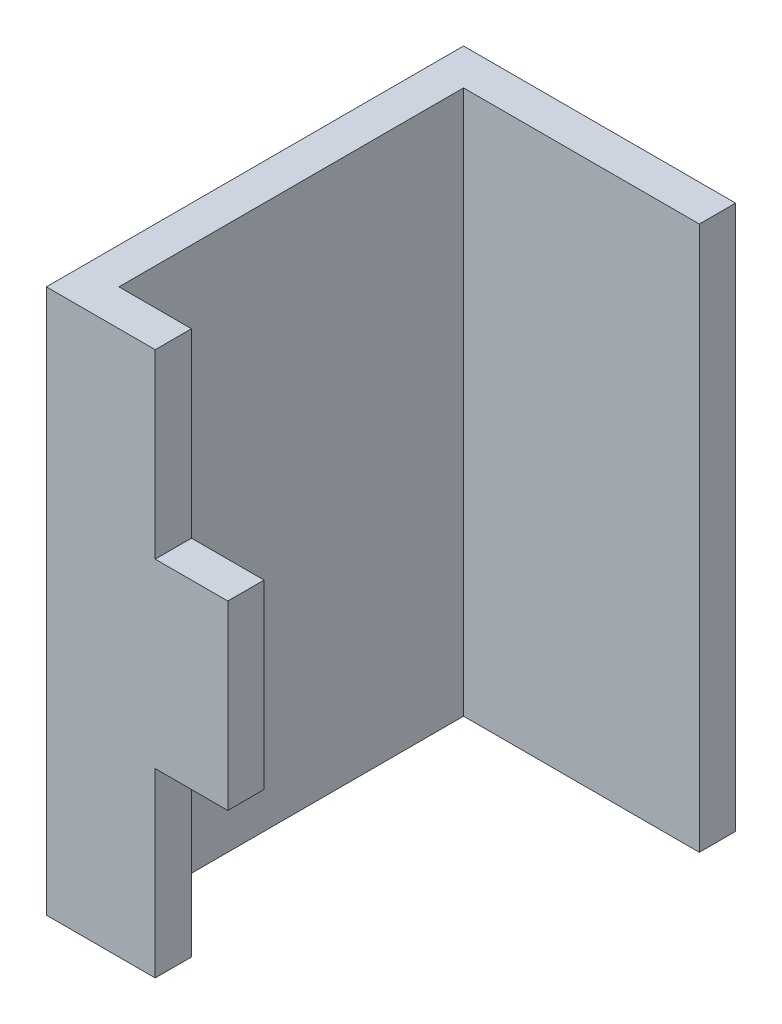
ISO-10303-21;
HEADER;
FILE_DESCRIPTION(('STEP AP214'),'2;1');
FILE_NAME('part.step','',(''),(''),'','','');
FILE_SCHEMA(('AUTOMOTIVE_DESIGN { 1 0 10303 214 1 1 1 1 }'));
ENDSEC;
DATA;
#1=APPLICATION_CONTEXT('core data for automotive mechanical design processes');
#2=APPLICATION_PROTOCOL_DEFINITION('international standard','automotive_design',2000,#1);
#3=PRODUCT_CONTEXT('',#1,'mechanical');
#4=PRODUCT('Part','Part','',(#3));
#5=PRODUCT_RELATED_PRODUCT_CATEGORY('part','',(#4));
#6=PRODUCT_DEFINITION_FORMATION('','',#4);
#7=PRODUCT_DEFINITION_CONTEXT('part definition',#1,'design');
#8=PRODUCT_DEFINITION('design','',#6,#7);
#9=PRODUCT_DEFINITION_SHAPE('','',#8);
#10=(LENGTH_UNIT() NAMED_UNIT(*) SI_UNIT(.MILLI.,.METRE.));
#11=(NAMED_UNIT(*) PLANE_ANGLE_UNIT() SI_UNIT($,.RADIAN.));
#12=(NAMED_UNIT(*) SI_UNIT($,.STERADIAN.) SOLID_ANGLE_UNIT());
#13=UNCERTAINTY_MEASURE_WITH_UNIT(LENGTH_MEASURE(1.E-05),#10,'distance_accuracy_value','');
#14=(GEOMETRIC_REPRESENTATION_CONTEXT(3) GLOBAL_UNCERTAINTY_ASSIGNED_CONTEXT((#13)) GLOBAL_UNIT_ASSIGNED_CONTEXT((#10,
#11,#12)) REPRESENTATION_CONTEXT('',''));
#15=CARTESIAN_POINT('',(0.,0.,0.));
#16=DIRECTION('',(0.,0.,1.));
#17=DIRECTION('',(1.,0.,0.));
#18=AXIS2_PLACEMENT_3D('',#15,#16,#17);
#19=CARTESIAN_POINT('',(7.69,2.458309395645,1.00916));
#20=DIRECTION('',(0.,0.,-1.));
#21=DIRECTION('',(-1.,0.,0.));
#22=AXIS2_PLACEMENT_3D('',#19,#20,#21);
#23=PLANE('',#22);
#24=DIRECTION('',(0.,1.,0.));
#25=VECTOR('',#24,1.);
#26=CARTESIAN_POINT('',(7.69,2.458309395645,1.00916));
#27=LINE('',#26,#25);
#28=CARTESIAN_POINT('',(7.69,3.0329,1.00916));
#29=VERTEX_POINT('',#28);
#30=CARTESIAN_POINT('',(7.69,2.7329,1.00916));
#31=VERTEX_POINT('',#30);
#32=EDGE_CURVE('E123',#29,#31,#27,.F.);
#33=ORIENTED_EDGE('',*,*,#32,.F.);
#34=DIRECTION('',(-1.,0.,0.));
#35=VECTOR('',#34,1.);
#36=CARTESIAN_POINT('',(7.69,3.0329,1.00916));
#37=LINE('',#36,#35);
#38=CARTESIAN_POINT('',(7.73,3.0329,1.00916));
#39=VERTEX_POINT('',#38);
#40=EDGE_CURVE('E111',#29,#39,#37,.F.);
#41=ORIENTED_EDGE('',*,*,#40,.T.);
#42=DIRECTION('',(0.,1.,0.));
#43=VECTOR('',#42,1.);
#44=CARTESIAN_POINT('',(7.73,3.0329,1.00916));
#45=LINE('',#44,#43);
#46=CARTESIAN_POINT('',(7.73,2.9329,1.00916));
#47=VERTEX_POINT('',#46);
#48=EDGE_CURVE('E117',#39,#47,#45,.F.);
#49=ORIENTED_EDGE('',*,*,#48,.T.);
#50=DIRECTION('',(1.,0.,0.));
#51=VECTOR('',#50,1.);
#52=CARTESIAN_POINT('',(7.73,2.9329,1.00916));
#53=LINE('',#52,#51);
#54=CARTESIAN_POINT('',(7.77,2.9329,1.00916));
#55=VERTEX_POINT('',#54);
#56=EDGE_CURVE('E144',#47,#55,#53,.T.);
#57=ORIENTED_EDGE('',*,*,#56,.T.);
#58=DIRECTION('',(0.,1.,0.));
#59=VECTOR('',#58,1.);
#60=CARTESIAN_POINT('',(7.77,2.458309395645,1.00916));
#61=LINE('',#60,#59);
#62=CARTESIAN_POINT('',(7.77,2.8329,1.00916));
#63=VERTEX_POINT('',#62);
#64=EDGE_CURVE('E139',#63,#55,#61,.T.);
#65=ORIENTED_EDGE('',*,*,#64,.F.);
#66=DIRECTION('',(1.,0.,0.));
#67=VECTOR('',#66,1.);
#68=CARTESIAN_POINT('',(7.73,2.8329,1.00916));
#69=LINE('',#68,#67);
#70=CARTESIAN_POINT('',(7.73,2.8329,1.00916));
#71=VERTEX_POINT('',#70);
#72=EDGE_CURVE('E134',#63,#71,#69,.F.);
#73=ORIENTED_EDGE('',*,*,#72,.T.);
#74=DIRECTION('',(0.,1.,0.));
#75=VECTOR('',#74,1.);
#76=CARTESIAN_POINT('',(7.73,2.7329,1.00916));
#77=LINE('',#76,#75);
#78=CARTESIAN_POINT('',(7.73,2.7329,1.00916));
#79=VERTEX_POINT('',#78);
#80=EDGE_CURVE('E103',#71,#79,#77,.F.);
#81=ORIENTED_EDGE('',*,*,#80,.T.);
#82=DIRECTION('',(-1.,0.,0.));
#83=VECTOR('',#82,1.);
#84=CARTESIAN_POINT('',(7.69,2.7329,1.00916));
#85=LINE('',#84,#83);
#86=EDGE_CURVE('E20',#79,#31,#85,.T.);
#87=ORIENTED_EDGE('',*,*,#86,.T.);
#88=EDGE_LOOP('',(#33,#41,#49,#57,#65,#73,#81,#87));
#89=FACE_BOUND('',#88,.T.);
#90=ADVANCED_FACE('F17',(#89),#23,.T.);
#91=CARTESIAN_POINT('',(7.73,3.0329,0.901456703857));
#92=DIRECTION('',(-1.,0.,0.));
#93=DIRECTION('',(0.,0.,1.));
#94=AXIS2_PLACEMENT_3D('',#91,#92,#93);
#95=PLANE('',#94);
#96=DIRECTION('',(0.,0.,1.));
#97=VECTOR('',#96,1.);
#98=CARTESIAN_POINT('',(7.73,3.0329,0.901456703857));
#99=LINE('',#98,#97);
#100=CARTESIAN_POINT('',(7.73,3.0329,1.02916));
#101=VERTEX_POINT('',#100);
#102=EDGE_CURVE('E107',#101,#39,#99,.F.);
#103=ORIENTED_EDGE('',*,*,#102,.F.);
#104=DIRECTION('',(0.,1.,0.));
#105=VECTOR('',#104,1.);
#106=CARTESIAN_POINT('',(7.73,2.458309395645,1.02916));
#107=LINE('',#106,#105);
#108=CARTESIAN_POINT('',(7.73,2.9329,1.02916));
#109=VERTEX_POINT('',#108);
#110=EDGE_CURVE('E161',#109,#101,#107,.T.);
#111=ORIENTED_EDGE('',*,*,#110,.F.);
#112=DIRECTION('',(0.,0.,-1.));
#113=VECTOR('',#112,1.);
#114=CARTESIAN_POINT('',(7.73,2.9329,0.901456703857));
#115=LINE('',#114,#113);
#116=EDGE_CURVE('E127',#109,#47,#115,.T.);
#117=ORIENTED_EDGE('',*,*,#116,.T.);
#118=ORIENTED_EDGE('',*,*,#48,.F.);
#119=EDGE_LOOP('',(#103,#111,#117,#118));
#120=FACE_BOUND('',#119,.T.);
#121=ADVANCED_FACE('F125',(#120),#95,.F.);
#122=CARTESIAN_POINT('',(7.73,2.7329,0.901456703857));
#123=DIRECTION('',(-1.,0.,0.));
#124=DIRECTION('',(0.,0.,1.));
#125=AXIS2_PLACEMENT_3D('',#122,#123,#124);
#126=PLANE('',#125);
#127=DIRECTION('',(0.,0.,1.));
#128=VECTOR('',#127,1.);
#129=CARTESIAN_POINT('',(7.73,2.8329,0.901456703857));
#130=LINE('',#129,#128);
#131=CARTESIAN_POINT('',(7.73,2.8329,1.02916));
#132=VERTEX_POINT('',#131);
#133=EDGE_CURVE('E130',#71,#132,#130,.T.);
#134=ORIENTED_EDGE('',*,*,#133,.T.);
#135=DIRECTION('',(0.,1.,0.));
#136=VECTOR('',#135,1.);
#137=CARTESIAN_POINT('',(7.73,2.458309395645,1.02916));
#138=LINE('',#137,#136);
#139=CARTESIAN_POINT('',(7.73,2.7329,1.02916));
#140=VERTEX_POINT('',#139);
#141=EDGE_CURVE('E166',#140,#132,#138,.T.);
#142=ORIENTED_EDGE('',*,*,#141,.F.);
#143=DIRECTION('',(0.,0.,1.));
#144=VECTOR('',#143,1.);
#145=CARTESIAN_POINT('',(7.73,2.7329,1.00916));
#146=LINE('',#145,#144);
#147=EDGE_CURVE('E159',#140,#79,#146,.F.);
#148=ORIENTED_EDGE('',*,*,#147,.T.);
#149=ORIENTED_EDGE('',*,*,#80,.F.);
#150=EDGE_LOOP('',(#134,#142,#148,#149));
#151=FACE_BOUND('',#150,.T.);
#152=ADVANCED_FACE('F218',(#151),#126,.F.);
#153=CARTESIAN_POINT('',(7.73,2.8329,0.901456703857));
#154=DIRECTION('',(0.,1.,0.));
#155=DIRECTION('',(0.,0.,1.));
#156=AXIS2_PLACEMENT_3D('',#153,#154,#155);
#157=PLANE('',#156);
#158=DIRECTION('',(0.,0.,-1.));
#159=VECTOR('',#158,1.);
#160=CARTESIAN_POINT('',(7.77,2.8329,1.00916));
#161=LINE('',#160,#159);
#162=CARTESIAN_POINT('',(7.77,2.8329,1.02916));
#163=VERTEX_POINT('',#162);
#164=EDGE_CURVE('E136',#163,#63,#161,.T.);
#165=ORIENTED_EDGE('',*,*,#164,.F.);
#166=DIRECTION('',(1.,0.,0.));
#167=VECTOR('',#166,1.);
#168=CARTESIAN_POINT('',(7.77,2.8329,1.02916));
#169=LINE('',#168,#167);
#170=EDGE_CURVE('E169',#132,#163,#169,.T.);
#171=ORIENTED_EDGE('',*,*,#170,.F.);
#172=ORIENTED_EDGE('',*,*,#133,.F.);
#173=ORIENTED_EDGE('',*,*,#72,.F.);
#174=EDGE_LOOP('',(#165,#171,#172,#173));
#175=FACE_BOUND('',#174,.T.);
#176=ADVANCED_FACE('F216',(#175),#157,.F.);
#177=CARTESIAN_POINT('',(7.77,2.458309395645,1.00916));
#178=DIRECTION('',(1.,0.,0.));
#179=DIRECTION('',(0.,0.,-1.));
#180=AXIS2_PLACEMENT_3D('',#177,#178,#179);
#181=PLANE('',#180);
#182=ORIENTED_EDGE('',*,*,#164,.T.);
#183=ORIENTED_EDGE('',*,*,#64,.T.);
#184=DIRECTION('',(0.,0.,-1.));
#185=VECTOR('',#184,1.);
#186=CARTESIAN_POINT('',(7.77,2.9329,0.901456703857));
#187=LINE('',#186,#185);
#188=CARTESIAN_POINT('',(7.77,2.9329,1.02916));
#189=VERTEX_POINT('',#188);
#190=EDGE_CURVE('E141',#55,#189,#187,.F.);
#191=ORIENTED_EDGE('',*,*,#190,.T.);
#192=DIRECTION('',(0.,1.,0.));
#193=VECTOR('',#192,1.);
#194=CARTESIAN_POINT('',(7.77,2.458309395645,1.02916));
#195=LINE('',#194,#193);
#196=EDGE_CURVE('E172',#163,#189,#195,.T.);
#197=ORIENTED_EDGE('',*,*,#196,.F.);
#198=EDGE_LOOP('',(#182,#183,#191,#197));
#199=FACE_BOUND('',#198,.T.);
#200=ADVANCED_FACE('F213',(#199),#181,.T.);
#201=CARTESIAN_POINT('',(7.73,2.9329,0.901456703857));
#202=DIRECTION('',(0.,-1.,0.));
#203=DIRECTION('',(0.,0.,-1.));
#204=AXIS2_PLACEMENT_3D('',#201,#202,#203);
#205=PLANE('',#204);
#206=ORIENTED_EDGE('',*,*,#116,.F.);
#207=DIRECTION('',(1.,0.,0.));
#208=VECTOR('',#207,1.);
#209=CARTESIAN_POINT('',(7.77,2.9329,1.02916));
#210=LINE('',#209,#208);
#211=EDGE_CURVE('E175',#189,#109,#210,.F.);
#212=ORIENTED_EDGE('',*,*,#211,.F.);
#213=ORIENTED_EDGE('',*,*,#190,.F.);
#214=ORIENTED_EDGE('',*,*,#56,.F.);
#215=EDGE_LOOP('',(#206,#212,#213,#214));
#216=FACE_BOUND('',#215,.T.);
#217=ADVANCED_FACE('F207',(#216),#205,.F.);
#218=CARTESIAN_POINT('',(7.69,2.458309395645,0.81916));
#219=DIRECTION('',(1.,0.,0.));
#220=DIRECTION('',(0.,0.,-1.));
#221=AXIS2_PLACEMENT_3D('',#218,#219,#220);
#222=PLANE('',#221);
#223=DIRECTION('',(0.,0.,1.));
#224=VECTOR('',#223,1.);
#225=CARTESIAN_POINT('',(7.69,3.0329,0.81916));
#226=LINE('',#225,#224);
#227=CARTESIAN_POINT('',(7.69,3.0329,0.81916));
#228=VERTEX_POINT('',#227);
#229=EDGE_CURVE('E178',#29,#228,#226,.F.);
#230=ORIENTED_EDGE('',*,*,#229,.F.);
#231=ORIENTED_EDGE('',*,*,#32,.T.);
#232=DIRECTION('',(0.,0.,1.));
#233=VECTOR('',#232,1.);
#234=CARTESIAN_POINT('',(7.69,2.7329,1.00916));
#235=LINE('',#234,#233);
#236=CARTESIAN_POINT('',(7.69,2.7329,0.81916));
#237=VERTEX_POINT('',#236);
#238=EDGE_CURVE('E153',#31,#237,#235,.F.);
#239=ORIENTED_EDGE('',*,*,#238,.T.);
#240=DIRECTION('',(0.,-1.,0.));
#241=VECTOR('',#240,1.);
#242=CARTESIAN_POINT('',(7.69,2.458309395645,0.81916));
#243=LINE('',#242,#241);
#244=EDGE_CURVE('E147',#228,#237,#243,.T.);
#245=ORIENTED_EDGE('',*,*,#244,.F.);
#246=EDGE_LOOP('',(#230,#231,#239,#245));
#247=FACE_BOUND('',#246,.T.);
#248=ADVANCED_FACE('F224',(#247),#222,.T.);
#249=CARTESIAN_POINT('',(7.82,2.458309395645,0.81916));
#250=DIRECTION('',(0.,0.,1.));
#251=DIRECTION('',(0.,-1.,0.));
#252=AXIS2_PLACEMENT_3D('',#249,#250,#251);
#253=PLANE('',#252);
#254=DIRECTION('',(1.,0.,0.));
#255=VECTOR('',#254,1.);
#256=CARTESIAN_POINT('',(7.97,3.0329,0.81916));
#257=LINE('',#256,#255);
#258=CARTESIAN_POINT('',(7.82,3.0329,0.81916));
#259=VERTEX_POINT('',#258);
#260=EDGE_CURVE('E180',#228,#259,#257,.T.);
#261=ORIENTED_EDGE('',*,*,#260,.F.);
#262=ORIENTED_EDGE('',*,*,#244,.T.);
#263=DIRECTION('',(1.,0.,0.));
#264=VECTOR('',#263,1.);
#265=CARTESIAN_POINT('',(7.69,2.7329,0.81916));
#266=LINE('',#265,#264);
#267=CARTESIAN_POINT('',(7.82,2.7329,0.81916));
#268=VERTEX_POINT('',#267);
#269=EDGE_CURVE('E155',#237,#268,#266,.T.);
#270=ORIENTED_EDGE('',*,*,#269,.T.);
#271=DIRECTION('',(0.,1.,0.));
#272=VECTOR('',#271,1.);
#273=CARTESIAN_POINT('',(7.82,2.458309395645,0.81916));
#274=LINE('',#273,#272);
#275=EDGE_CURVE('E150',#259,#268,#274,.F.);
#276=ORIENTED_EDGE('',*,*,#275,.F.);
#277=EDGE_LOOP('',(#261,#262,#270,#276));
#278=FACE_BOUND('',#277,.T.);
#279=ADVANCED_FACE('F229',(#278),#253,.T.);
#280=CARTESIAN_POINT('',(7.82,2.458309395645,0.79916));
#281=DIRECTION('',(1.,0.,0.));
#282=DIRECTION('',(0.,0.,-1.));
#283=AXIS2_PLACEMENT_3D('',#280,#281,#282);
#284=PLANE('',#283);
#285=DIRECTION('',(0.,0.,1.));
#286=VECTOR('',#285,1.);
#287=CARTESIAN_POINT('',(7.82,3.0329,0.81916));
#288=LINE('',#287,#286);
#289=CARTESIAN_POINT('',(7.82,3.0329,0.79916));
#290=VERTEX_POINT('',#289);
#291=EDGE_CURVE('E183',#259,#290,#288,.F.);
#292=ORIENTED_EDGE('',*,*,#291,.F.);
#293=ORIENTED_EDGE('',*,*,#275,.T.);
#294=DIRECTION('',(0.,0.,1.));
#295=VECTOR('',#294,1.);
#296=CARTESIAN_POINT('',(7.82,2.7329,1.00916));
#297=LINE('',#296,#295);
#298=CARTESIAN_POINT('',(7.82,2.7329,0.79916));
#299=VERTEX_POINT('',#298);
#300=EDGE_CURVE('E157',#268,#299,#297,.F.);
#301=ORIENTED_EDGE('',*,*,#300,.T.);
#302=DIRECTION('',(0.,1.,0.));
#303=VECTOR('',#302,1.);
#304=CARTESIAN_POINT('',(7.82,2.458309395645,0.79916));
#305=LINE('',#304,#303);
#306=EDGE_CURVE('E190',#290,#299,#305,.F.);
#307=ORIENTED_EDGE('',*,*,#306,.F.);
#308=EDGE_LOOP('',(#292,#293,#301,#307));
#309=FACE_BOUND('',#308,.T.);
#310=ADVANCED_FACE('F232',(#309),#284,.T.);
#311=CARTESIAN_POINT('',(7.69,2.7329,1.00916));
#312=DIRECTION('',(0.,1.,0.));
#313=DIRECTION('',(0.,0.,1.));
#314=AXIS2_PLACEMENT_3D('',#311,#312,#313);
#315=PLANE('',#314);
#316=ORIENTED_EDGE('',*,*,#147,.F.);
#317=DIRECTION('',(1.,0.,0.));
#318=VECTOR('',#317,1.);
#319=CARTESIAN_POINT('',(7.77,2.7329,1.02916));
#320=LINE('',#319,#318);
#321=CARTESIAN_POINT('',(7.67,2.7329,1.02916));
#322=VERTEX_POINT('',#321);
#323=EDGE_CURVE('E163',#322,#140,#320,.T.);
#324=ORIENTED_EDGE('',*,*,#323,.F.);
#325=DIRECTION('',(0.,0.,1.));
#326=VECTOR('',#325,1.);
#327=CARTESIAN_POINT('',(7.67,2.7329,1.02916));
#328=LINE('',#327,#326);
#329=CARTESIAN_POINT('',(7.67,2.7329,0.79916));
#330=VERTEX_POINT('',#329);
#331=EDGE_CURVE('E193',#330,#322,#328,.T.);
#332=ORIENTED_EDGE('',*,*,#331,.F.);
#333=DIRECTION('',(-1.,0.,0.));
#334=VECTOR('',#333,1.);
#335=CARTESIAN_POINT('',(7.67,2.7329,0.79916));
#336=LINE('',#335,#334);
#337=EDGE_CURVE('E186',#299,#330,#336,.T.);
#338=ORIENTED_EDGE('',*,*,#337,.F.);
#339=ORIENTED_EDGE('',*,*,#300,.F.);
#340=ORIENTED_EDGE('',*,*,#269,.F.);
#341=ORIENTED_EDGE('',*,*,#238,.F.);
#342=ORIENTED_EDGE('',*,*,#86,.F.);
#343=EDGE_LOOP('',(#316,#324,#332,#338,#339,#340,#341,#342));
#344=FACE_BOUND('',#343,.T.);
#345=ADVANCED_FACE('F220',(#344),#315,.F.);
#346=CARTESIAN_POINT('',(7.77,2.458309395645,1.02916));
#347=DIRECTION('',(0.,0.,1.));
#348=DIRECTION('',(1.,0.,0.));
#349=AXIS2_PLACEMENT_3D('',#346,#347,#348);
#350=PLANE('',#349);
#351=ORIENTED_EDGE('',*,*,#196,.T.);
#352=ORIENTED_EDGE('',*,*,#211,.T.);
#353=ORIENTED_EDGE('',*,*,#110,.T.);
#354=DIRECTION('',(1.,0.,0.));
#355=VECTOR('',#354,1.);
#356=CARTESIAN_POINT('',(7.97,3.0329,1.02916));
#357=LINE('',#356,#355);
#358=CARTESIAN_POINT('',(7.67,3.0329,1.02916));
#359=VERTEX_POINT('',#358);
#360=EDGE_CURVE('E113',#359,#101,#357,.T.);
#361=ORIENTED_EDGE('',*,*,#360,.F.);
#362=DIRECTION('',(0.,1.,0.));
#363=VECTOR('',#362,1.);
#364=CARTESIAN_POINT('',(7.67,2.458309395645,1.02916));
#365=LINE('',#364,#363);
#366=EDGE_CURVE('E196',#322,#359,#365,.T.);
#367=ORIENTED_EDGE('',*,*,#366,.F.);
#368=ORIENTED_EDGE('',*,*,#323,.T.);
#369=ORIENTED_EDGE('',*,*,#141,.T.);
#370=ORIENTED_EDGE('',*,*,#170,.T.);
#371=EDGE_LOOP('',(#351,#352,#353,#361,#367,#368,#369,#370));
#372=FACE_BOUND('',#371,.T.);
#373=ADVANCED_FACE('F204',(#372),#350,.T.);
#374=CARTESIAN_POINT('',(7.97,3.0329,0.81916));
#375=DIRECTION('',(0.,1.,0.));
#376=DIRECTION('',(0.,0.,1.));
#377=AXIS2_PLACEMENT_3D('',#374,#375,#376);
#378=PLANE('',#377);
#379=DIRECTION('',(0.,0.,1.));
#380=VECTOR('',#379,1.);
#381=CARTESIAN_POINT('',(7.67,3.0329,1.02916));
#382=LINE('',#381,#380);
#383=CARTESIAN_POINT('',(7.67,3.0329,0.79916));
#384=VERTEX_POINT('',#383);
#385=EDGE_CURVE('E26',#359,#384,#382,.F.);
#386=ORIENTED_EDGE('',*,*,#385,.F.);
#387=ORIENTED_EDGE('',*,*,#360,.T.);
#388=ORIENTED_EDGE('',*,*,#102,.T.);
#389=ORIENTED_EDGE('',*,*,#40,.F.);
#390=ORIENTED_EDGE('',*,*,#229,.T.);
#391=ORIENTED_EDGE('',*,*,#260,.T.);
#392=ORIENTED_EDGE('',*,*,#291,.T.);
#393=DIRECTION('',(-1.,0.,0.));
#394=VECTOR('',#393,1.);
#395=CARTESIAN_POINT('',(7.67,3.0329,0.79916));
#396=LINE('',#395,#394);
#397=EDGE_CURVE('E35',#384,#290,#396,.F.);
#398=ORIENTED_EDGE('',*,*,#397,.F.);
#399=EDGE_LOOP('',(#386,#387,#388,#389,#390,#391,#392,#398));
#400=FACE_BOUND('',#399,.T.);
#401=ADVANCED_FACE('F109',(#400),#378,.T.);
#402=CARTESIAN_POINT('',(7.67,2.458309395645,0.79916));
#403=DIRECTION('',(0.,0.,-1.));
#404=DIRECTION('',(-1.,0.,0.));
#405=AXIS2_PLACEMENT_3D('',#402,#403,#404);
#406=PLANE('',#405);
#407=ORIENTED_EDGE('',*,*,#397,.T.);
#408=ORIENTED_EDGE('',*,*,#306,.T.);
#409=ORIENTED_EDGE('',*,*,#337,.T.);
#410=DIRECTION('',(0.,1.,0.));
#411=VECTOR('',#410,1.);
#412=CARTESIAN_POINT('',(7.67,2.458309395645,0.79916));
#413=LINE('',#412,#411);
#414=EDGE_CURVE('E11',#384,#330,#413,.F.);
#415=ORIENTED_EDGE('',*,*,#414,.F.);
#416=EDGE_LOOP('',(#407,#408,#409,#415));
#417=FACE_BOUND('',#416,.T.);
#418=ADVANCED_FACE('F235',(#417),#406,.T.);
#419=CARTESIAN_POINT('',(7.67,2.458309395645,1.02916));
#420=DIRECTION('',(-1.,0.,0.));
#421=DIRECTION('',(0.,0.,1.));
#422=AXIS2_PLACEMENT_3D('',#419,#420,#421);
#423=PLANE('',#422);
#424=ORIENTED_EDGE('',*,*,#385,.T.);
#425=ORIENTED_EDGE('',*,*,#414,.T.);
#426=ORIENTED_EDGE('',*,*,#331,.T.);
#427=ORIENTED_EDGE('',*,*,#366,.T.);
#428=EDGE_LOOP('',(#424,#425,#426,#427));
#429=FACE_BOUND('',#428,.T.);
#430=ADVANCED_FACE('F201',(#429),#423,.T.);
#431=CLOSED_SHELL('',(#90,#121,#152,#176,#200,#217,#248,#279,#310,#345,#373,#401,#418,#430));
#432=MANIFOLD_SOLID_BREP('B1',#431);
#433=ADVANCED_BREP_SHAPE_REPRESENTATION('',(#18,#432),#14);
#434=SHAPE_DEFINITION_REPRESENTATION(#9,#433);
ENDSEC;
END-ISO-10303-21;
